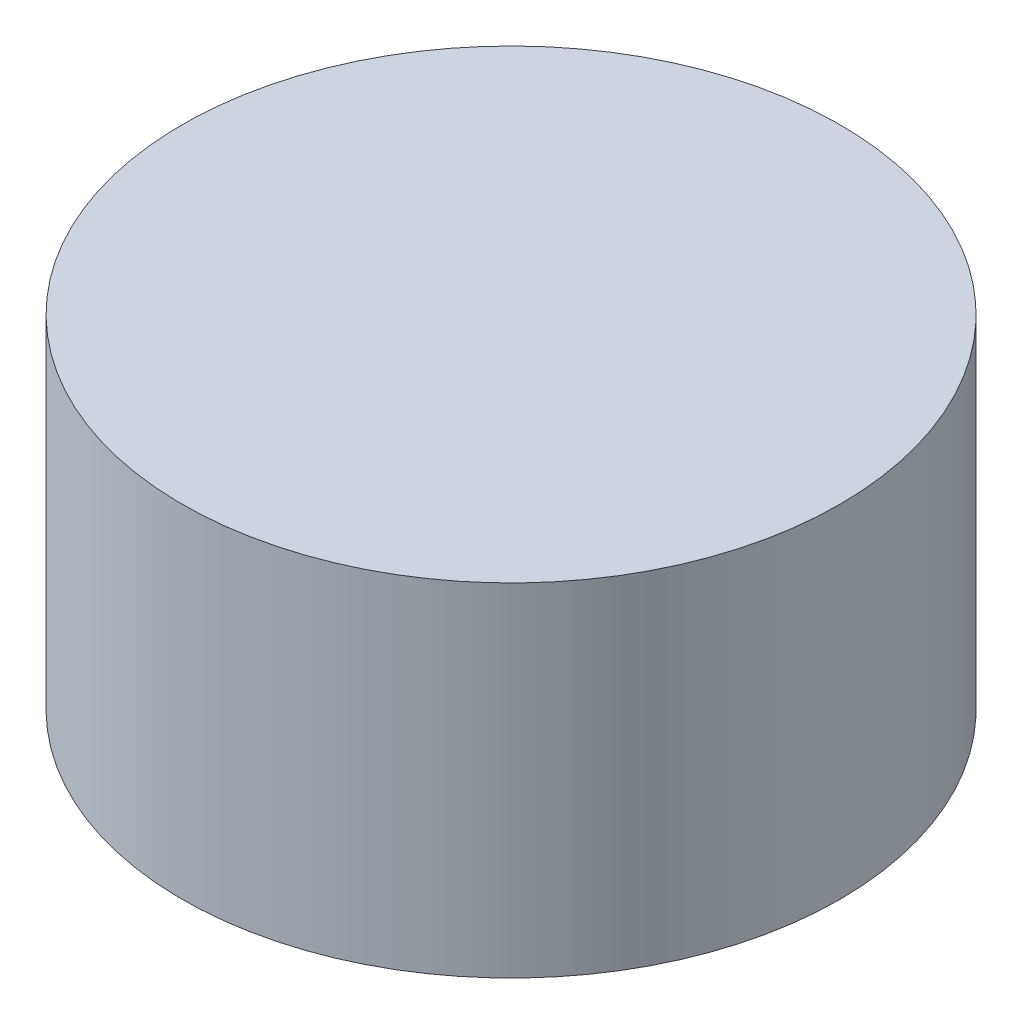
ISO-10303-21;
HEADER;
FILE_DESCRIPTION(('STEP AP214'),'2;1');
FILE_NAME('part.step','',(''),(''),'','','');
FILE_SCHEMA(('AUTOMOTIVE_DESIGN { 1 0 10303 214 1 1 1 1 }'));
ENDSEC;
DATA;
#1=APPLICATION_CONTEXT('core data for automotive mechanical design processes');
#2=APPLICATION_PROTOCOL_DEFINITION('international standard','automotive_design',2000,#1);
#3=PRODUCT_CONTEXT('',#1,'mechanical');
#4=PRODUCT('Part','Part','',(#3));
#5=PRODUCT_RELATED_PRODUCT_CATEGORY('part','',(#4));
#6=PRODUCT_DEFINITION_FORMATION('','',#4);
#7=PRODUCT_DEFINITION_CONTEXT('part definition',#1,'design');
#8=PRODUCT_DEFINITION('design','',#6,#7);
#9=PRODUCT_DEFINITION_SHAPE('','',#8);
#10=(LENGTH_UNIT() NAMED_UNIT(*) SI_UNIT(.MILLI.,.METRE.));
#11=(NAMED_UNIT(*) PLANE_ANGLE_UNIT() SI_UNIT($,.RADIAN.));
#12=(NAMED_UNIT(*) SI_UNIT($,.STERADIAN.) SOLID_ANGLE_UNIT());
#13=UNCERTAINTY_MEASURE_WITH_UNIT(LENGTH_MEASURE(1.E-05),#10,'distance_accuracy_value','');
#14=(GEOMETRIC_REPRESENTATION_CONTEXT(3) GLOBAL_UNCERTAINTY_ASSIGNED_CONTEXT((#13)) GLOBAL_UNIT_ASSIGNED_CONTEXT((#10,
#11,#12)) REPRESENTATION_CONTEXT('',''));
#15=CARTESIAN_POINT('',(0.,0.,0.));
#16=DIRECTION('',(0.,0.,1.));
#17=DIRECTION('',(1.,0.,0.));
#18=AXIS2_PLACEMENT_3D('',#15,#16,#17);
#19=CARTESIAN_POINT('',(-7.51914930649351E-12,-24.6750506500045,1019.9001013));
#20=DIRECTION('',(0.,-1.,0.));
#21=DIRECTION('',(0.,0.,-1.));
#22=AXIS2_PLACEMENT_3D('',#19,#20,#21);
#23=PLANE('',#22);
#24=CARTESIAN_POINT('',(-7.51914930649351E-12,-24.6750506500045,1019.9001013));
#25=DIRECTION('',(0.,-1.,0.));
#26=DIRECTION('',(-1.,0.,0.));
#27=AXIS2_PLACEMENT_3D('',#24,#25,#26);
#28=CIRCLE('',#27,30.75);
#29=CARTESIAN_POINT('',(30.7499999999925,-24.6750506500042,1019.9001013));
#30=VERTEX_POINT('',#29);
#31=EDGE_CURVE('E11',#30,#30,#28,.T.);
#32=ORIENTED_EDGE('',*,*,#31,.F.);
#33=EDGE_LOOP('',(#32));
#34=FACE_BOUND('',#33,.T.);
#35=ADVANCED_FACE('F17',(#34),#23,.F.);
#36=CARTESIAN_POINT('',(-7.25447213742287E-12,-56.6750506500044,1019.9001013));
#37=DIRECTION('',(0.,-1.,0.));
#38=DIRECTION('',(0.,0.,-1.));
#39=AXIS2_PLACEMENT_3D('',#36,#37,#38);
#40=PLANE('',#39);
#41=CARTESIAN_POINT('',(-7.25447213742287E-12,-56.6750506500044,1019.9001013));
#42=DIRECTION('',(0.,-1.,0.));
#43=DIRECTION('',(-1.,0.,0.));
#44=AXIS2_PLACEMENT_3D('',#41,#42,#43);
#45=CIRCLE('',#44,30.75);
#46=CARTESIAN_POINT('',(30.7499999999928,-56.6750506500042,1019.9001013));
#47=VERTEX_POINT('',#46);
#48=EDGE_CURVE('E27',#47,#47,#45,.T.);
#49=ORIENTED_EDGE('',*,*,#48,.T.);
#50=EDGE_LOOP('',(#49));
#51=FACE_BOUND('',#50,.T.);
#52=ADVANCED_FACE('F19',(#51),#40,.T.);
#53=CARTESIAN_POINT('',(-7.25447213742287E-12,-56.6750506500044,1019.9001013));
#54=DIRECTION('',(0.,1.,0.));
#55=DIRECTION('',(1.,0.,0.));
#56=AXIS2_PLACEMENT_3D('',#53,#54,#55);
#57=CYLINDRICAL_SURFACE('',#56,30.75);
#58=ORIENTED_EDGE('',*,*,#31,.T.);
#59=EDGE_LOOP('',(#58));
#60=FACE_BOUND('',#59,.T.);
#61=ORIENTED_EDGE('',*,*,#48,.F.);
#62=EDGE_LOOP('',(#61));
#63=FACE_BOUND('',#62,.T.);
#64=ADVANCED_FACE('F55',(#60,#63),#57,.T.);
#65=CLOSED_SHELL('',(#35,#52,#64));
#66=MANIFOLD_SOLID_BREP('B1',#65);
#67=ADVANCED_BREP_SHAPE_REPRESENTATION('',(#18,#66),#14);
#68=SHAPE_DEFINITION_REPRESENTATION(#9,#67);
ENDSEC;
END-ISO-10303-21;
